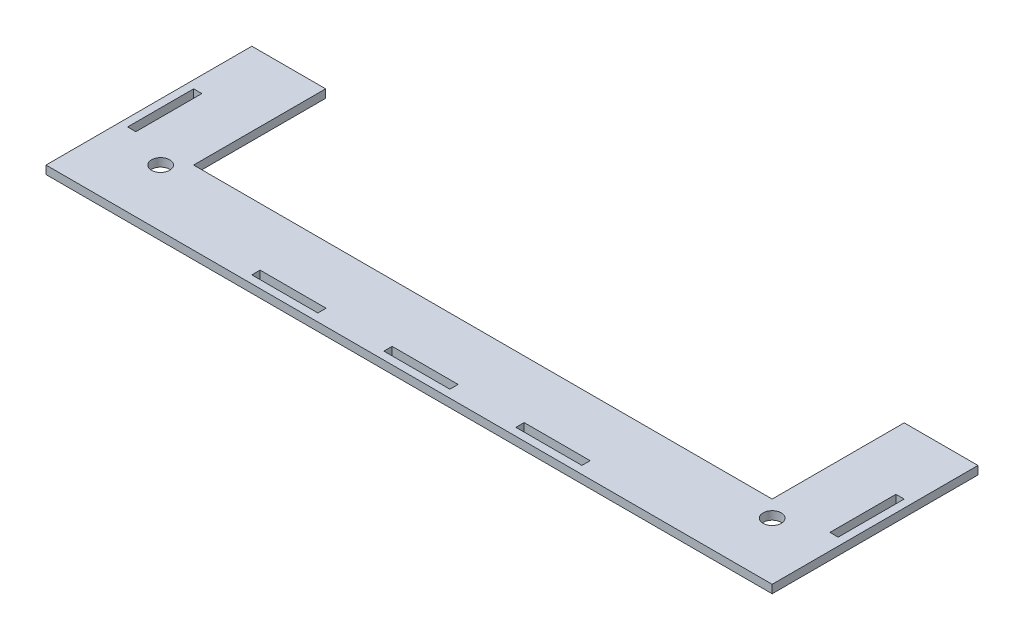
ISO-10303-21;
HEADER;
FILE_DESCRIPTION(('STEP AP214'),'2;1');
FILE_NAME('part.step','',(''),(''),'','','');
FILE_SCHEMA(('AUTOMOTIVE_DESIGN { 1 0 10303 214 1 1 1 1 }'));
ENDSEC;
DATA;
#1=APPLICATION_CONTEXT('core data for automotive mechanical design processes');
#2=APPLICATION_PROTOCOL_DEFINITION('international standard','automotive_design',2000,#1);
#3=PRODUCT_CONTEXT('',#1,'mechanical');
#4=PRODUCT('Part','Part','',(#3));
#5=PRODUCT_RELATED_PRODUCT_CATEGORY('part','',(#4));
#6=PRODUCT_DEFINITION_FORMATION('','',#4);
#7=PRODUCT_DEFINITION_CONTEXT('part definition',#1,'design');
#8=PRODUCT_DEFINITION('design','',#6,#7);
#9=PRODUCT_DEFINITION_SHAPE('','',#8);
#10=(LENGTH_UNIT() NAMED_UNIT(*) SI_UNIT(.MILLI.,.METRE.));
#11=(NAMED_UNIT(*) PLANE_ANGLE_UNIT() SI_UNIT($,.RADIAN.));
#12=(NAMED_UNIT(*) SI_UNIT($,.STERADIAN.) SOLID_ANGLE_UNIT());
#13=UNCERTAINTY_MEASURE_WITH_UNIT(LENGTH_MEASURE(1.E-05),#10,'distance_accuracy_value','');
#14=(GEOMETRIC_REPRESENTATION_CONTEXT(3) GLOBAL_UNCERTAINTY_ASSIGNED_CONTEXT((#13)) GLOBAL_UNIT_ASSIGNED_CONTEXT((#10,
#11,#12)) REPRESENTATION_CONTEXT('',''));
#15=CARTESIAN_POINT('',(0.,0.,0.));
#16=DIRECTION('',(0.,0.,1.));
#17=DIRECTION('',(1.,0.,0.));
#18=AXIS2_PLACEMENT_3D('',#15,#16,#17);
#19=CARTESIAN_POINT('',(63.5,3.175,0.));
#20=DIRECTION('',(-1.,0.,0.));
#21=DIRECTION('',(0.,0.,1.));
#22=AXIS2_PLACEMENT_3D('',#19,#20,#21);
#23=PLANE('',#22);
#24=DIRECTION('',(0.,0.,-1.));
#25=VECTOR('',#24,1.);
#26=CARTESIAN_POINT('',(63.5,0.,0.));
#27=LINE('',#26,#25);
#28=CARTESIAN_POINT('',(63.5,0.,12.7));
#29=VERTEX_POINT('',#28);
#30=CARTESIAN_POINT('',(63.5,0.,9.52500000000007));
#31=VERTEX_POINT('',#30);
#32=EDGE_CURVE('E400',#29,#31,#27,.T.);
#33=ORIENTED_EDGE('',*,*,#32,.F.);
#34=DIRECTION('',(0.,-1.,0.));
#35=VECTOR('',#34,1.);
#36=CARTESIAN_POINT('',(63.5,3.175,12.7));
#37=LINE('',#36,#35);
#38=CARTESIAN_POINT('',(63.5,3.175,12.7));
#39=VERTEX_POINT('',#38);
#40=EDGE_CURVE('E11',#39,#29,#37,.T.);
#41=ORIENTED_EDGE('',*,*,#40,.F.);
#42=DIRECTION('',(0.,0.,-1.));
#43=VECTOR('',#42,1.);
#44=CARTESIAN_POINT('',(63.5,3.175,0.));
#45=LINE('',#44,#43);
#46=CARTESIAN_POINT('',(63.5,3.175,9.52500000000007));
#47=VERTEX_POINT('',#46);
#48=EDGE_CURVE('E249',#39,#47,#45,.T.);
#49=ORIENTED_EDGE('',*,*,#48,.T.);
#50=DIRECTION('',(0.,-1.,0.));
#51=VECTOR('',#50,1.);
#52=CARTESIAN_POINT('',(63.5,3.175,9.52500000000007));
#53=LINE('',#52,#51);
#54=EDGE_CURVE('E154',#47,#31,#53,.T.);
#55=ORIENTED_EDGE('',*,*,#54,.T.);
#56=EDGE_LOOP('',(#33,#41,#49,#55));
#57=FACE_BOUND('',#56,.T.);
#58=ADVANCED_FACE('F41',(#57),#23,.T.);
#59=CARTESIAN_POINT('',(0.,3.175,12.7));
#60=DIRECTION('',(0.,0.,1.));
#61=DIRECTION('',(1.,0.,0.));
#62=AXIS2_PLACEMENT_3D('',#59,#60,#61);
#63=PLANE('',#62);
#64=DIRECTION('',(-1.,0.,0.));
#65=VECTOR('',#64,1.);
#66=CARTESIAN_POINT('',(0.,0.,12.7));
#67=LINE('',#66,#65);
#68=CARTESIAN_POINT('',(38.1,0.,12.7));
#69=VERTEX_POINT('',#68);
#70=EDGE_CURVE('E256',#29,#69,#67,.T.);
#71=ORIENTED_EDGE('',*,*,#70,.T.);
#72=DIRECTION('',(0.,-1.,0.));
#73=VECTOR('',#72,1.);
#74=CARTESIAN_POINT('',(38.1,3.175,12.7));
#75=LINE('',#74,#73);
#76=CARTESIAN_POINT('',(38.1,3.175,12.7));
#77=VERTEX_POINT('',#76);
#78=EDGE_CURVE('E51',#77,#69,#75,.T.);
#79=ORIENTED_EDGE('',*,*,#78,.F.);
#80=DIRECTION('',(-1.,0.,0.));
#81=VECTOR('',#80,1.);
#82=CARTESIAN_POINT('',(0.,3.175,12.7));
#83=LINE('',#82,#81);
#84=EDGE_CURVE('E244',#39,#77,#83,.T.);
#85=ORIENTED_EDGE('',*,*,#84,.F.);
#86=ORIENTED_EDGE('',*,*,#40,.T.);
#87=EDGE_LOOP('',(#71,#79,#85,#86));
#88=FACE_BOUND('',#87,.T.);
#89=ADVANCED_FACE('F254',(#88),#63,.F.);
#90=CARTESIAN_POINT('',(38.1,3.175,0.));
#91=DIRECTION('',(-1.,0.,0.));
#92=DIRECTION('',(0.,0.,1.));
#93=AXIS2_PLACEMENT_3D('',#90,#91,#92);
#94=PLANE('',#93);
#95=DIRECTION('',(0.,0.,-1.));
#96=VECTOR('',#95,1.);
#97=CARTESIAN_POINT('',(38.1,0.,0.));
#98=LINE('',#97,#96);
#99=CARTESIAN_POINT('',(38.1,0.,9.52500000000007));
#100=VERTEX_POINT('',#99);
#101=EDGE_CURVE('E402',#69,#100,#98,.T.);
#102=ORIENTED_EDGE('',*,*,#101,.T.);
#103=DIRECTION('',(0.,-1.,0.));
#104=VECTOR('',#103,1.);
#105=CARTESIAN_POINT('',(38.1,3.175,9.52500000000007));
#106=LINE('',#105,#104);
#107=CARTESIAN_POINT('',(38.1,3.175,9.52500000000007));
#108=VERTEX_POINT('',#107);
#109=EDGE_CURVE('E243',#108,#100,#106,.T.);
#110=ORIENTED_EDGE('',*,*,#109,.F.);
#111=DIRECTION('',(0.,0.,-1.));
#112=VECTOR('',#111,1.);
#113=CARTESIAN_POINT('',(38.1,3.175,0.));
#114=LINE('',#113,#112);
#115=EDGE_CURVE('E237',#77,#108,#114,.T.);
#116=ORIENTED_EDGE('',*,*,#115,.F.);
#117=ORIENTED_EDGE('',*,*,#78,.T.);
#118=EDGE_LOOP('',(#102,#110,#116,#117));
#119=FACE_BOUND('',#118,.T.);
#120=ADVANCED_FACE('F240',(#119),#94,.F.);
#121=CARTESIAN_POINT('',(12.7,3.175,0.));
#122=DIRECTION('',(-1.,0.,0.));
#123=DIRECTION('',(0.,0.,1.));
#124=AXIS2_PLACEMENT_3D('',#121,#122,#123);
#125=PLANE('',#124);
#126=DIRECTION('',(0.,0.,-1.));
#127=VECTOR('',#126,1.);
#128=CARTESIAN_POINT('',(12.7,0.,0.));
#129=LINE('',#128,#127);
#130=CARTESIAN_POINT('',(12.7,0.,12.7));
#131=VERTEX_POINT('',#130);
#132=CARTESIAN_POINT('',(12.7,0.,9.52500000000007));
#133=VERTEX_POINT('',#132);
#134=EDGE_CURVE('E391',#131,#133,#129,.T.);
#135=ORIENTED_EDGE('',*,*,#134,.F.);
#136=DIRECTION('',(0.,-1.,0.));
#137=VECTOR('',#136,1.);
#138=CARTESIAN_POINT('',(12.7,3.175,12.7));
#139=LINE('',#138,#137);
#140=CARTESIAN_POINT('',(12.7,3.175,12.7));
#141=VERTEX_POINT('',#140);
#142=EDGE_CURVE('E270',#141,#131,#139,.T.);
#143=ORIENTED_EDGE('',*,*,#142,.F.);
#144=DIRECTION('',(0.,0.,-1.));
#145=VECTOR('',#144,1.);
#146=CARTESIAN_POINT('',(12.7,3.175,0.));
#147=LINE('',#146,#145);
#148=CARTESIAN_POINT('',(12.7,3.175,9.52500000000007));
#149=VERTEX_POINT('',#148);
#150=EDGE_CURVE('E463',#141,#149,#147,.T.);
#151=ORIENTED_EDGE('',*,*,#150,.T.);
#152=DIRECTION('',(0.,-1.,0.));
#153=VECTOR('',#152,1.);
#154=CARTESIAN_POINT('',(12.7,3.175,9.52500000000007));
#155=LINE('',#154,#153);
#156=EDGE_CURVE('E261',#149,#133,#155,.T.);
#157=ORIENTED_EDGE('',*,*,#156,.T.);
#158=EDGE_LOOP('',(#135,#143,#151,#157));
#159=FACE_BOUND('',#158,.T.);
#160=ADVANCED_FACE('F514',(#159),#125,.T.);
#161=CARTESIAN_POINT('',(-12.7,0.,12.7));
#162=VERTEX_POINT('',#161);
#163=EDGE_CURVE('E385',#131,#162,#67,.T.);
#164=ORIENTED_EDGE('',*,*,#163,.T.);
#165=DIRECTION('',(0.,-1.,0.));
#166=VECTOR('',#165,1.);
#167=CARTESIAN_POINT('',(-12.7,3.175,12.7));
#168=LINE('',#167,#166);
#169=CARTESIAN_POINT('',(-12.7,3.175,12.7));
#170=VERTEX_POINT('',#169);
#171=EDGE_CURVE('E267',#170,#162,#168,.T.);
#172=ORIENTED_EDGE('',*,*,#171,.F.);
#173=EDGE_CURVE('E252',#141,#170,#83,.T.);
#174=ORIENTED_EDGE('',*,*,#173,.F.);
#175=ORIENTED_EDGE('',*,*,#142,.T.);
#176=EDGE_LOOP('',(#164,#172,#174,#175));
#177=FACE_BOUND('',#176,.T.);
#178=ADVANCED_FACE('F500',(#177),#63,.F.);
#179=CARTESIAN_POINT('',(-12.7,3.175,0.));
#180=DIRECTION('',(-1.,0.,0.));
#181=DIRECTION('',(0.,0.,1.));
#182=AXIS2_PLACEMENT_3D('',#179,#180,#181);
#183=PLANE('',#182);
#184=DIRECTION('',(0.,0.,-1.));
#185=VECTOR('',#184,1.);
#186=CARTESIAN_POINT('',(-12.7,0.,0.));
#187=LINE('',#186,#185);
#188=CARTESIAN_POINT('',(-12.7,0.,9.52500000000007));
#189=VERTEX_POINT('',#188);
#190=EDGE_CURVE('E394',#162,#189,#187,.T.);
#191=ORIENTED_EDGE('',*,*,#190,.T.);
#192=DIRECTION('',(0.,-1.,0.));
#193=VECTOR('',#192,1.);
#194=CARTESIAN_POINT('',(-12.7,3.175,9.52500000000007));
#195=LINE('',#194,#193);
#196=CARTESIAN_POINT('',(-12.7,3.175,9.52500000000007));
#197=VERTEX_POINT('',#196);
#198=EDGE_CURVE('E263',#197,#189,#195,.T.);
#199=ORIENTED_EDGE('',*,*,#198,.F.);
#200=DIRECTION('',(0.,0.,-1.));
#201=VECTOR('',#200,1.);
#202=CARTESIAN_POINT('',(-12.7,3.175,0.));
#203=LINE('',#202,#201);
#204=EDGE_CURVE('E466',#170,#197,#203,.T.);
#205=ORIENTED_EDGE('',*,*,#204,.F.);
#206=ORIENTED_EDGE('',*,*,#171,.T.);
#207=EDGE_LOOP('',(#191,#199,#205,#206));
#208=FACE_BOUND('',#207,.T.);
#209=ADVANCED_FACE('F509',(#208),#183,.F.);
#210=CARTESIAN_POINT('',(-38.1,3.175,0.));
#211=DIRECTION('',(-1.,0.,0.));
#212=DIRECTION('',(0.,0.,1.));
#213=AXIS2_PLACEMENT_3D('',#210,#211,#212);
#214=PLANE('',#213);
#215=DIRECTION('',(0.,0.,-1.));
#216=VECTOR('',#215,1.);
#217=CARTESIAN_POINT('',(-38.1,0.,0.));
#218=LINE('',#217,#216);
#219=CARTESIAN_POINT('',(-38.1,0.,12.7));
#220=VERTEX_POINT('',#219);
#221=CARTESIAN_POINT('',(-38.1,0.,9.52500000000007));
#222=VERTEX_POINT('',#221);
#223=EDGE_CURVE('E378',#220,#222,#218,.T.);
#224=ORIENTED_EDGE('',*,*,#223,.F.);
#225=DIRECTION('',(0.,-1.,0.));
#226=VECTOR('',#225,1.);
#227=CARTESIAN_POINT('',(-38.1,3.175,12.7));
#228=LINE('',#227,#226);
#229=CARTESIAN_POINT('',(-38.1,3.175,12.7));
#230=VERTEX_POINT('',#229);
#231=EDGE_CURVE('E264',#230,#220,#228,.T.);
#232=ORIENTED_EDGE('',*,*,#231,.F.);
#233=DIRECTION('',(0.,0.,-1.));
#234=VECTOR('',#233,1.);
#235=CARTESIAN_POINT('',(-38.1,3.175,0.));
#236=LINE('',#235,#234);
#237=CARTESIAN_POINT('',(-38.1,3.175,9.52500000000007));
#238=VERTEX_POINT('',#237);
#239=EDGE_CURVE('E454',#230,#238,#236,.T.);
#240=ORIENTED_EDGE('',*,*,#239,.T.);
#241=DIRECTION('',(0.,-1.,0.));
#242=VECTOR('',#241,1.);
#243=CARTESIAN_POINT('',(-38.1,3.175,9.52500000000007));
#244=LINE('',#243,#242);
#245=EDGE_CURVE('E272',#238,#222,#244,.T.);
#246=ORIENTED_EDGE('',*,*,#245,.T.);
#247=EDGE_LOOP('',(#224,#232,#240,#246));
#248=FACE_BOUND('',#247,.T.);
#249=ADVANCED_FACE('F512',(#248),#214,.T.);
#250=CARTESIAN_POINT('',(-63.5,0.,12.7));
#251=VERTEX_POINT('',#250);
#252=EDGE_CURVE('E381',#220,#251,#67,.T.);
#253=ORIENTED_EDGE('',*,*,#252,.T.);
#254=DIRECTION('',(0.,-1.,0.));
#255=VECTOR('',#254,1.);
#256=CARTESIAN_POINT('',(-63.5,3.175,12.7));
#257=LINE('',#256,#255);
#258=CARTESIAN_POINT('',(-63.5,3.175,12.7));
#259=VERTEX_POINT('',#258);
#260=EDGE_CURVE('E278',#259,#251,#257,.T.);
#261=ORIENTED_EDGE('',*,*,#260,.F.);
#262=EDGE_CURVE('E253',#230,#259,#83,.T.);
#263=ORIENTED_EDGE('',*,*,#262,.F.);
#264=ORIENTED_EDGE('',*,*,#231,.T.);
#265=EDGE_LOOP('',(#253,#261,#263,#264));
#266=FACE_BOUND('',#265,.T.);
#267=ADVANCED_FACE('F499',(#266),#63,.F.);
#268=CARTESIAN_POINT('',(-63.5,3.175,0.));
#269=DIRECTION('',(-1.,0.,0.));
#270=DIRECTION('',(0.,0.,1.));
#271=AXIS2_PLACEMENT_3D('',#268,#269,#270);
#272=PLANE('',#271);
#273=DIRECTION('',(0.,0.,-1.));
#274=VECTOR('',#273,1.);
#275=CARTESIAN_POINT('',(-63.5,0.,0.));
#276=LINE('',#275,#274);
#277=CARTESIAN_POINT('',(-63.5,0.,9.52500000000007));
#278=VERTEX_POINT('',#277);
#279=EDGE_CURVE('E384',#251,#278,#276,.T.);
#280=ORIENTED_EDGE('',*,*,#279,.T.);
#281=DIRECTION('',(0.,-1.,0.));
#282=VECTOR('',#281,1.);
#283=CARTESIAN_POINT('',(-63.5,3.175,9.52500000000007));
#284=LINE('',#283,#282);
#285=CARTESIAN_POINT('',(-63.5,3.175,9.52500000000007));
#286=VERTEX_POINT('',#285);
#287=EDGE_CURVE('E274',#286,#278,#284,.T.);
#288=ORIENTED_EDGE('',*,*,#287,.F.);
#289=DIRECTION('',(0.,0.,-1.));
#290=VECTOR('',#289,1.);
#291=CARTESIAN_POINT('',(-63.5,3.175,0.));
#292=LINE('',#291,#290);
#293=EDGE_CURVE('E458',#259,#286,#292,.T.);
#294=ORIENTED_EDGE('',*,*,#293,.F.);
#295=ORIENTED_EDGE('',*,*,#260,.T.);
#296=EDGE_LOOP('',(#280,#288,#294,#295));
#297=FACE_BOUND('',#296,.T.);
#298=ADVANCED_FACE('F522',(#297),#272,.F.);
#299=CARTESIAN_POINT('',(0.,3.175,-12.7000000000001));
#300=DIRECTION('',(0.,0.,-1.));
#301=DIRECTION('',(-1.,0.,0.));
#302=AXIS2_PLACEMENT_3D('',#299,#300,#301);
#303=PLANE('',#302);
#304=DIRECTION('',(1.,0.,0.));
#305=VECTOR('',#304,1.);
#306=CARTESIAN_POINT('',(0.,0.,-12.7000000000001));
#307=LINE('',#306,#305);
#308=CARTESIAN_POINT('',(-136.7,0.,-12.7000000000001));
#309=VERTEX_POINT('',#308);
#310=CARTESIAN_POINT('',(-133.525,0.,-12.7000000000001));
#311=VERTEX_POINT('',#310);
#312=EDGE_CURVE('E366',#309,#311,#307,.T.);
#313=ORIENTED_EDGE('',*,*,#312,.F.);
#314=DIRECTION('',(0.,-1.,0.));
#315=VECTOR('',#314,1.);
#316=CARTESIAN_POINT('',(-136.7,3.175,-12.7000000000001));
#317=LINE('',#316,#315);
#318=CARTESIAN_POINT('',(-136.7,3.175,-12.7000000000001));
#319=VERTEX_POINT('',#318);
#320=EDGE_CURVE('E275',#319,#309,#317,.T.);
#321=ORIENTED_EDGE('',*,*,#320,.F.);
#322=DIRECTION('',(1.,0.,0.));
#323=VECTOR('',#322,1.);
#324=CARTESIAN_POINT('',(0.,3.175,-12.7000000000001));
#325=LINE('',#324,#323);
#326=CARTESIAN_POINT('',(-133.525,3.175,-12.7000000000001));
#327=VERTEX_POINT('',#326);
#328=EDGE_CURVE('E443',#319,#327,#325,.T.);
#329=ORIENTED_EDGE('',*,*,#328,.T.);
#330=DIRECTION('',(0.,-1.,0.));
#331=VECTOR('',#330,1.);
#332=CARTESIAN_POINT('',(-133.525,3.175,-12.7000000000001));
#333=LINE('',#332,#331);
#334=EDGE_CURVE('E282',#327,#311,#333,.T.);
#335=ORIENTED_EDGE('',*,*,#334,.T.);
#336=EDGE_LOOP('',(#313,#321,#329,#335));
#337=FACE_BOUND('',#336,.T.);
#338=ADVANCED_FACE('F525',(#337),#303,.T.);
#339=CARTESIAN_POINT('',(-136.7,3.175,0.));
#340=DIRECTION('',(-1.,0.,0.));
#341=DIRECTION('',(0.,0.,1.));
#342=AXIS2_PLACEMENT_3D('',#339,#340,#341);
#343=PLANE('',#342);
#344=DIRECTION('',(0.,0.,-1.));
#345=VECTOR('',#344,1.);
#346=CARTESIAN_POINT('',(-136.7,0.,0.));
#347=LINE('',#346,#345);
#348=CARTESIAN_POINT('',(-136.7,0.,-38.1));
#349=VERTEX_POINT('',#348);
#350=EDGE_CURVE('E369',#309,#349,#347,.T.);
#351=ORIENTED_EDGE('',*,*,#350,.T.);
#352=DIRECTION('',(0.,-1.,0.));
#353=VECTOR('',#352,1.);
#354=CARTESIAN_POINT('',(-136.7,3.175,-38.1));
#355=LINE('',#354,#353);
#356=CARTESIAN_POINT('',(-136.7,3.175,-38.1));
#357=VERTEX_POINT('',#356);
#358=EDGE_CURVE('E287',#357,#349,#355,.T.);
#359=ORIENTED_EDGE('',*,*,#358,.F.);
#360=DIRECTION('',(0.,0.,-1.));
#361=VECTOR('',#360,1.);
#362=CARTESIAN_POINT('',(-136.7,3.175,0.));
#363=LINE('',#362,#361);
#364=EDGE_CURVE('E446',#319,#357,#363,.T.);
#365=ORIENTED_EDGE('',*,*,#364,.F.);
#366=ORIENTED_EDGE('',*,*,#320,.T.);
#367=EDGE_LOOP('',(#351,#359,#365,#366));
#368=FACE_BOUND('',#367,.T.);
#369=ADVANCED_FACE('F538',(#368),#343,.F.);
#370=CARTESIAN_POINT('',(0.,3.175,-38.0999999999997));
#371=DIRECTION('',(0.,0.,-1.));
#372=DIRECTION('',(-1.,0.,0.));
#373=AXIS2_PLACEMENT_3D('',#370,#371,#372);
#374=PLANE('',#373);
#375=DIRECTION('',(1.,0.,0.));
#376=VECTOR('',#375,1.);
#377=CARTESIAN_POINT('',(0.,0.,-38.0999999999997));
#378=LINE('',#377,#376);
#379=CARTESIAN_POINT('',(-133.525,0.,-38.1));
#380=VERTEX_POINT('',#379);
#381=EDGE_CURVE('E372',#349,#380,#378,.T.);
#382=ORIENTED_EDGE('',*,*,#381,.T.);
#383=DIRECTION('',(0.,-1.,0.));
#384=VECTOR('',#383,1.);
#385=CARTESIAN_POINT('',(-133.525,3.175,-38.1));
#386=LINE('',#385,#384);
#387=CARTESIAN_POINT('',(-133.525,3.175,-38.1));
#388=VERTEX_POINT('',#387);
#389=EDGE_CURVE('E284',#388,#380,#386,.T.);
#390=ORIENTED_EDGE('',*,*,#389,.F.);
#391=DIRECTION('',(1.,0.,0.));
#392=VECTOR('',#391,1.);
#393=CARTESIAN_POINT('',(0.,3.175,-38.0999999999997));
#394=LINE('',#393,#392);
#395=EDGE_CURVE('E449',#357,#388,#394,.T.);
#396=ORIENTED_EDGE('',*,*,#395,.F.);
#397=ORIENTED_EDGE('',*,*,#358,.T.);
#398=EDGE_LOOP('',(#382,#390,#396,#397));
#399=FACE_BOUND('',#398,.T.);
#400=ADVANCED_FACE('F534',(#399),#374,.F.);
#401=CARTESIAN_POINT('',(0.,3.175,-63.5));
#402=DIRECTION('',(0.,0.,-1.));
#403=DIRECTION('',(-1.,0.,0.));
#404=AXIS2_PLACEMENT_3D('',#401,#402,#403);
#405=PLANE('',#404);
#406=DIRECTION('',(1.,0.,0.));
#407=VECTOR('',#406,1.);
#408=CARTESIAN_POINT('',(0.,0.,-63.5));
#409=LINE('',#408,#407);
#410=CARTESIAN_POINT('',(-139.7,0.,-63.5));
#411=VERTEX_POINT('',#410);
#412=CARTESIAN_POINT('',(-111.3,0.,-63.5));
#413=VERTEX_POINT('',#412);
#414=EDGE_CURVE('E342',#411,#413,#409,.T.);
#415=ORIENTED_EDGE('',*,*,#414,.F.);
#416=DIRECTION('',(0.,-1.,0.));
#417=VECTOR('',#416,1.);
#418=CARTESIAN_POINT('',(-139.7,3.175,-63.5));
#419=LINE('',#418,#417);
#420=CARTESIAN_POINT('',(-139.7,3.175,-63.5));
#421=VERTEX_POINT('',#420);
#422=EDGE_CURVE('E285',#421,#411,#419,.T.);
#423=ORIENTED_EDGE('',*,*,#422,.F.);
#424=DIRECTION('',(1.,0.,0.));
#425=VECTOR('',#424,1.);
#426=CARTESIAN_POINT('',(0.,3.175,-63.5));
#427=LINE('',#426,#425);
#428=CARTESIAN_POINT('',(-111.3,3.175,-63.5));
#429=VERTEX_POINT('',#428);
#430=EDGE_CURVE('E420',#421,#429,#427,.T.);
#431=ORIENTED_EDGE('',*,*,#430,.T.);
#432=DIRECTION('',(0.,-1.,0.));
#433=VECTOR('',#432,1.);
#434=CARTESIAN_POINT('',(-111.3,3.175,-63.5));
#435=LINE('',#434,#433);
#436=EDGE_CURVE('E291',#429,#413,#435,.T.);
#437=ORIENTED_EDGE('',*,*,#436,.T.);
#438=EDGE_LOOP('',(#415,#423,#431,#437));
#439=FACE_BOUND('',#438,.T.);
#440=ADVANCED_FACE('F537',(#439),#405,.T.);
#441=CARTESIAN_POINT('',(-139.7,3.175,0.));
#442=DIRECTION('',(1.,0.,0.));
#443=DIRECTION('',(0.,0.,-1.));
#444=AXIS2_PLACEMENT_3D('',#441,#442,#443);
#445=PLANE('',#444);
#446=DIRECTION('',(0.,0.,1.));
#447=VECTOR('',#446,1.);
#448=CARTESIAN_POINT('',(-139.7,0.,0.));
#449=LINE('',#448,#447);
#450=CARTESIAN_POINT('',(-139.7,0.,15.7));
#451=VERTEX_POINT('',#450);
#452=EDGE_CURVE('E345',#411,#451,#449,.T.);
#453=ORIENTED_EDGE('',*,*,#452,.T.);
#454=DIRECTION('',(0.,-1.,0.));
#455=VECTOR('',#454,1.);
#456=CARTESIAN_POINT('',(-139.7,3.175,15.7));
#457=LINE('',#456,#455);
#458=CARTESIAN_POINT('',(-139.7,3.175,15.7));
#459=VERTEX_POINT('',#458);
#460=EDGE_CURVE('E304',#459,#451,#457,.T.);
#461=ORIENTED_EDGE('',*,*,#460,.F.);
#462=DIRECTION('',(0.,0.,1.));
#463=VECTOR('',#462,1.);
#464=CARTESIAN_POINT('',(-139.7,3.175,0.));
#465=LINE('',#464,#463);
#466=EDGE_CURVE('E423',#421,#459,#465,.T.);
#467=ORIENTED_EDGE('',*,*,#466,.F.);
#468=ORIENTED_EDGE('',*,*,#422,.T.);
#469=EDGE_LOOP('',(#453,#461,#467,#468));
#470=FACE_BOUND('',#469,.T.);
#471=ADVANCED_FACE('F568',(#470),#445,.F.);
#472=CARTESIAN_POINT('',(0.,3.175,15.7));
#473=DIRECTION('',(0.,0.,-1.));
#474=DIRECTION('',(-1.,0.,0.));
#475=AXIS2_PLACEMENT_3D('',#472,#473,#474);
#476=PLANE('',#475);
#477=DIRECTION('',(1.,0.,0.));
#478=VECTOR('',#477,1.);
#479=CARTESIAN_POINT('',(0.,0.,15.7));
#480=LINE('',#479,#478);
#481=CARTESIAN_POINT('',(139.7,0.,15.7));
#482=VERTEX_POINT('',#481);
#483=EDGE_CURVE('E348',#451,#482,#480,.T.);
#484=ORIENTED_EDGE('',*,*,#483,.T.);
#485=DIRECTION('',(0.,-1.,0.));
#486=VECTOR('',#485,1.);
#487=CARTESIAN_POINT('',(139.7,3.175,15.7));
#488=LINE('',#487,#486);
#489=CARTESIAN_POINT('',(139.7,3.175,15.7));
#490=VERTEX_POINT('',#489);
#491=EDGE_CURVE('E301',#490,#482,#488,.T.);
#492=ORIENTED_EDGE('',*,*,#491,.F.);
#493=DIRECTION('',(1.,0.,0.));
#494=VECTOR('',#493,1.);
#495=CARTESIAN_POINT('',(0.,3.175,15.7));
#496=LINE('',#495,#494);
#497=EDGE_CURVE('E426',#459,#490,#496,.T.);
#498=ORIENTED_EDGE('',*,*,#497,.F.);
#499=ORIENTED_EDGE('',*,*,#460,.T.);
#500=EDGE_LOOP('',(#484,#492,#498,#499));
#501=FACE_BOUND('',#500,.T.);
#502=ADVANCED_FACE('F564',(#501),#476,.F.);
#503=CARTESIAN_POINT('',(139.7,3.175,0.));
#504=DIRECTION('',(-1.,0.,0.));
#505=DIRECTION('',(0.,0.,1.));
#506=AXIS2_PLACEMENT_3D('',#503,#504,#505);
#507=PLANE('',#506);
#508=DIRECTION('',(0.,0.,-1.));
#509=VECTOR('',#508,1.);
#510=CARTESIAN_POINT('',(139.7,0.,0.));
#511=LINE('',#510,#509);
#512=CARTESIAN_POINT('',(139.7,0.,-63.5));
#513=VERTEX_POINT('',#512);
#514=EDGE_CURVE('E351',#482,#513,#511,.T.);
#515=ORIENTED_EDGE('',*,*,#514,.T.);
#516=DIRECTION('',(0.,-1.,0.));
#517=VECTOR('',#516,1.);
#518=CARTESIAN_POINT('',(139.7,3.175,-63.5));
#519=LINE('',#518,#517);
#520=CARTESIAN_POINT('',(139.7,3.175,-63.5));
#521=VERTEX_POINT('',#520);
#522=EDGE_CURVE('E299',#521,#513,#519,.T.);
#523=ORIENTED_EDGE('',*,*,#522,.F.);
#524=DIRECTION('',(0.,0.,-1.));
#525=VECTOR('',#524,1.);
#526=CARTESIAN_POINT('',(139.7,3.175,0.));
#527=LINE('',#526,#525);
#528=EDGE_CURVE('E429',#490,#521,#527,.T.);
#529=ORIENTED_EDGE('',*,*,#528,.F.);
#530=ORIENTED_EDGE('',*,*,#491,.T.);
#531=EDGE_LOOP('',(#515,#523,#529,#530));
#532=FACE_BOUND('',#531,.T.);
#533=ADVANCED_FACE('F560',(#532),#507,.F.);
#534=CARTESIAN_POINT('',(0.,3.175,-63.5));
#535=DIRECTION('',(0.,0.,-1.));
#536=DIRECTION('',(-1.,0.,0.));
#537=AXIS2_PLACEMENT_3D('',#534,#535,#536);
#538=PLANE('',#537);
#539=DIRECTION('',(1.,0.,0.));
#540=VECTOR('',#539,1.);
#541=CARTESIAN_POINT('',(0.,0.,-63.5));
#542=LINE('',#541,#540);
#543=CARTESIAN_POINT('',(111.3,0.,-63.5));
#544=VERTEX_POINT('',#543);
#545=EDGE_CURVE('E354',#544,#513,#542,.T.);
#546=ORIENTED_EDGE('',*,*,#545,.F.);
#547=DIRECTION('',(0.,-1.,0.));
#548=VECTOR('',#547,1.);
#549=CARTESIAN_POINT('',(111.3,3.175,-63.5));
#550=LINE('',#549,#548);
#551=CARTESIAN_POINT('',(111.3,3.175,-63.5));
#552=VERTEX_POINT('',#551);
#553=EDGE_CURVE('E297',#552,#544,#550,.T.);
#554=ORIENTED_EDGE('',*,*,#553,.F.);
#555=DIRECTION('',(1.,0.,0.));
#556=VECTOR('',#555,1.);
#557=CARTESIAN_POINT('',(0.,3.175,-63.5));
#558=LINE('',#557,#556);
#559=EDGE_CURVE('E431',#552,#521,#558,.T.);
#560=ORIENTED_EDGE('',*,*,#559,.T.);
#561=ORIENTED_EDGE('',*,*,#522,.T.);
#562=EDGE_LOOP('',(#546,#554,#560,#561));
#563=FACE_BOUND('',#562,.T.);
#564=ADVANCED_FACE('F556',(#563),#538,.T.);
#565=CARTESIAN_POINT('',(111.3,3.175,0.));
#566=DIRECTION('',(-1.,0.,0.));
#567=DIRECTION('',(0.,0.,1.));
#568=AXIS2_PLACEMENT_3D('',#565,#566,#567);
#569=PLANE('',#568);
#570=DIRECTION('',(0.,0.,-1.));
#571=VECTOR('',#570,1.);
#572=CARTESIAN_POINT('',(111.3,0.,0.));
#573=LINE('',#572,#571);
#574=CARTESIAN_POINT('',(111.3,0.,-12.7));
#575=VERTEX_POINT('',#574);
#576=EDGE_CURVE('E357',#575,#544,#573,.T.);
#577=ORIENTED_EDGE('',*,*,#576,.F.);
#578=DIRECTION('',(0.,-1.,0.));
#579=VECTOR('',#578,1.);
#580=CARTESIAN_POINT('',(111.3,3.175,-12.7));
#581=LINE('',#580,#579);
#582=CARTESIAN_POINT('',(111.3,3.175,-12.7));
#583=VERTEX_POINT('',#582);
#584=EDGE_CURVE('E295',#583,#575,#581,.T.);
#585=ORIENTED_EDGE('',*,*,#584,.F.);
#586=DIRECTION('',(0.,0.,-1.));
#587=VECTOR('',#586,1.);
#588=CARTESIAN_POINT('',(111.3,3.175,0.));
#589=LINE('',#588,#587);
#590=EDGE_CURVE('E434',#583,#552,#589,.T.);
#591=ORIENTED_EDGE('',*,*,#590,.T.);
#592=ORIENTED_EDGE('',*,*,#553,.T.);
#593=EDGE_LOOP('',(#577,#585,#591,#592));
#594=FACE_BOUND('',#593,.T.);
#595=ADVANCED_FACE('F552',(#594),#569,.T.);
#596=CARTESIAN_POINT('',(0.,3.175,-12.7));
#597=DIRECTION('',(0.,0.,-1.));
#598=DIRECTION('',(-1.,0.,0.));
#599=AXIS2_PLACEMENT_3D('',#596,#597,#598);
#600=PLANE('',#599);
#601=DIRECTION('',(1.,0.,0.));
#602=VECTOR('',#601,1.);
#603=CARTESIAN_POINT('',(0.,0.,-12.7));
#604=LINE('',#603,#602);
#605=CARTESIAN_POINT('',(-111.3,0.,-12.7));
#606=VERTEX_POINT('',#605);
#607=EDGE_CURVE('E360',#606,#575,#604,.T.);
#608=ORIENTED_EDGE('',*,*,#607,.F.);
#609=DIRECTION('',(0.,-1.,0.));
#610=VECTOR('',#609,1.);
#611=CARTESIAN_POINT('',(-111.3,3.175,-12.7));
#612=LINE('',#611,#610);
#613=CARTESIAN_POINT('',(-111.3,3.175,-12.7));
#614=VERTEX_POINT('',#613);
#615=EDGE_CURVE('E293',#614,#606,#612,.T.);
#616=ORIENTED_EDGE('',*,*,#615,.F.);
#617=DIRECTION('',(1.,0.,0.));
#618=VECTOR('',#617,1.);
#619=CARTESIAN_POINT('',(0.,3.175,-12.7));
#620=LINE('',#619,#618);
#621=EDGE_CURVE('E437',#614,#583,#620,.T.);
#622=ORIENTED_EDGE('',*,*,#621,.T.);
#623=ORIENTED_EDGE('',*,*,#584,.T.);
#624=EDGE_LOOP('',(#608,#616,#622,#623));
#625=FACE_BOUND('',#624,.T.);
#626=ADVANCED_FACE('F549',(#625),#600,.T.);
#627=CARTESIAN_POINT('',(-1.16573417585628E-12,3.175,-38.0999999999959));
#628=DIRECTION('',(0.,0.,1.));
#629=DIRECTION('',(1.,0.,0.));
#630=AXIS2_PLACEMENT_3D('',#627,#628,#629);
#631=PLANE('',#630);
#632=DIRECTION('',(-1.,0.,0.));
#633=VECTOR('',#632,1.);
#634=CARTESIAN_POINT('',(-1.16573417585628E-12,0.,-38.0999999999959));
#635=LINE('',#634,#633);
#636=CARTESIAN_POINT('',(136.7,0.,-38.1));
#637=VERTEX_POINT('',#636);
#638=CARTESIAN_POINT('',(133.525,0.,-38.0999999999999));
#639=VERTEX_POINT('',#638);
#640=EDGE_CURVE('E330',#637,#639,#635,.T.);
#641=ORIENTED_EDGE('',*,*,#640,.F.);
#642=DIRECTION('',(0.,-1.,0.));
#643=VECTOR('',#642,1.);
#644=CARTESIAN_POINT('',(136.7,3.175,-38.1));
#645=LINE('',#644,#643);
#646=CARTESIAN_POINT('',(136.7,3.175,-38.1));
#647=VERTEX_POINT('',#646);
#648=EDGE_CURVE('E45',#647,#637,#645,.T.);
#649=ORIENTED_EDGE('',*,*,#648,.F.);
#650=DIRECTION('',(-1.,0.,0.));
#651=VECTOR('',#650,1.);
#652=CARTESIAN_POINT('',(-1.16573417585628E-12,3.175,-38.0999999999959));
#653=LINE('',#652,#651);
#654=CARTESIAN_POINT('',(133.525,3.175,-38.0999999999999));
#655=VERTEX_POINT('',#654);
#656=EDGE_CURVE('E410',#647,#655,#653,.T.);
#657=ORIENTED_EDGE('',*,*,#656,.T.);
#658=DIRECTION('',(0.,-1.,0.));
#659=VECTOR('',#658,1.);
#660=CARTESIAN_POINT('',(133.525,3.175,-38.0999999999999));
#661=LINE('',#660,#659);
#662=EDGE_CURVE('E308',#655,#639,#661,.T.);
#663=ORIENTED_EDGE('',*,*,#662,.T.);
#664=EDGE_LOOP('',(#641,#649,#657,#663));
#665=FACE_BOUND('',#664,.T.);
#666=ADVANCED_FACE('F43',(#665),#631,.T.);
#667=CARTESIAN_POINT('',(136.7,3.175,0.));
#668=DIRECTION('',(1.,0.,0.));
#669=DIRECTION('',(0.,0.,-1.));
#670=AXIS2_PLACEMENT_3D('',#667,#668,#669);
#671=PLANE('',#670);
#672=DIRECTION('',(0.,0.,1.));
#673=VECTOR('',#672,1.);
#674=CARTESIAN_POINT('',(136.7,0.,0.));
#675=LINE('',#674,#673);
#676=CARTESIAN_POINT('',(136.7,0.,-12.7));
#677=VERTEX_POINT('',#676);
#678=EDGE_CURVE('E322',#637,#677,#675,.T.);
#679=ORIENTED_EDGE('',*,*,#678,.T.);
#680=DIRECTION('',(0.,-1.,0.));
#681=VECTOR('',#680,1.);
#682=CARTESIAN_POINT('',(136.7,3.175,-12.7));
#683=LINE('',#682,#681);
#684=CARTESIAN_POINT('',(136.7,3.175,-12.7));
#685=VERTEX_POINT('',#684);
#686=EDGE_CURVE('E313',#685,#677,#683,.T.);
#687=ORIENTED_EDGE('',*,*,#686,.F.);
#688=DIRECTION('',(0.,0.,1.));
#689=VECTOR('',#688,1.);
#690=CARTESIAN_POINT('',(136.7,3.175,0.));
#691=LINE('',#690,#689);
#692=EDGE_CURVE('E323',#647,#685,#691,.T.);
#693=ORIENTED_EDGE('',*,*,#692,.F.);
#694=ORIENTED_EDGE('',*,*,#648,.T.);
#695=EDGE_LOOP('',(#679,#687,#693,#694));
#696=FACE_BOUND('',#695,.T.);
#697=ADVANCED_FACE('F321',(#696),#671,.F.);
#698=CARTESIAN_POINT('',(-5.96744875735722E-13,3.175,-12.6999999999937));
#699=DIRECTION('',(0.,0.,1.));
#700=DIRECTION('',(1.,0.,0.));
#701=AXIS2_PLACEMENT_3D('',#698,#699,#700);
#702=PLANE('',#701);
#703=DIRECTION('',(-1.,0.,0.));
#704=VECTOR('',#703,1.);
#705=CARTESIAN_POINT('',(-5.96744875735722E-13,0.,-12.6999999999937));
#706=LINE('',#705,#704);
#707=CARTESIAN_POINT('',(133.525,0.,-12.7));
#708=VERTEX_POINT('',#707);
#709=EDGE_CURVE('E331',#677,#708,#706,.T.);
#710=ORIENTED_EDGE('',*,*,#709,.T.);
#711=DIRECTION('',(0.,-1.,0.));
#712=VECTOR('',#711,1.);
#713=CARTESIAN_POINT('',(133.525,3.175,-12.7));
#714=LINE('',#713,#712);
#715=CARTESIAN_POINT('',(133.525,3.175,-12.7));
#716=VERTEX_POINT('',#715);
#717=EDGE_CURVE('E310',#716,#708,#714,.T.);
#718=ORIENTED_EDGE('',*,*,#717,.F.);
#719=DIRECTION('',(-1.,0.,0.));
#720=VECTOR('',#719,1.);
#721=CARTESIAN_POINT('',(-5.96744875735722E-13,3.175,-12.6999999999937));
#722=LINE('',#721,#720);
#723=EDGE_CURVE('E414',#685,#716,#722,.T.);
#724=ORIENTED_EDGE('',*,*,#723,.F.);
#725=ORIENTED_EDGE('',*,*,#686,.T.);
#726=EDGE_LOOP('',(#710,#718,#724,#725));
#727=FACE_BOUND('',#726,.T.);
#728=ADVANCED_FACE('F579',(#727),#702,.F.);
#729=CARTESIAN_POINT('',(117.65,3.175,-6.35000000000001));
#730=DIRECTION('',(0.,-1.,0.));
#731=DIRECTION('',(0.,0.,-1.));
#732=AXIS2_PLACEMENT_3D('',#729,#730,#731);
#733=CYLINDRICAL_SURFACE('',#732,3.49999999999999);
#734=CARTESIAN_POINT('',(117.65,3.175,-6.35000000000001));
#735=DIRECTION('',(0.,1.,0.));
#736=DIRECTION('',(0.,0.,1.));
#737=AXIS2_PLACEMENT_3D('',#734,#735,#736);
#738=CIRCLE('',#737,3.49999999999999);
#739=CARTESIAN_POINT('',(117.65,3.175,-2.85000000000002));
#740=VERTEX_POINT('',#739);
#741=EDGE_CURVE('E472',#740,#740,#738,.T.);
#742=ORIENTED_EDGE('',*,*,#741,.T.);
#743=EDGE_LOOP('',(#742));
#744=FACE_BOUND('',#743,.T.);
#745=CARTESIAN_POINT('',(117.65,0.,-6.35000000000001));
#746=DIRECTION('',(0.,1.,0.));
#747=DIRECTION('',(0.,0.,1.));
#748=AXIS2_PLACEMENT_3D('',#745,#746,#747);
#749=CIRCLE('',#748,3.49999999999999);
#750=CARTESIAN_POINT('',(117.65,0.,-2.85000000000002));
#751=VERTEX_POINT('',#750);
#752=EDGE_CURVE('E405',#751,#751,#749,.T.);
#753=ORIENTED_EDGE('',*,*,#752,.F.);
#754=EDGE_LOOP('',(#753));
#755=FACE_BOUND('',#754,.T.);
#756=ADVANCED_FACE('F581',(#744,#755),#733,.F.);
#757=CARTESIAN_POINT('',(0.,3.175,9.52500000000007));
#758=DIRECTION('',(0.,0.,-1.));
#759=DIRECTION('',(-1.,0.,0.));
#760=AXIS2_PLACEMENT_3D('',#757,#758,#759);
#761=PLANE('',#760);
#762=DIRECTION('',(1.,0.,0.));
#763=VECTOR('',#762,1.);
#764=CARTESIAN_POINT('',(0.,0.,9.52500000000007));
#765=LINE('',#764,#763);
#766=EDGE_CURVE('E147',#100,#31,#765,.T.);
#767=ORIENTED_EDGE('',*,*,#766,.T.);
#768=ORIENTED_EDGE('',*,*,#54,.F.);
#769=DIRECTION('',(1.,0.,0.));
#770=VECTOR('',#769,1.);
#771=CARTESIAN_POINT('',(0.,3.175,9.52500000000007));
#772=LINE('',#771,#770);
#773=EDGE_CURVE('E60',#108,#47,#772,.T.);
#774=ORIENTED_EDGE('',*,*,#773,.F.);
#775=ORIENTED_EDGE('',*,*,#109,.T.);
#776=EDGE_LOOP('',(#767,#768,#774,#775));
#777=FACE_BOUND('',#776,.T.);
#778=ADVANCED_FACE('F507',(#777),#761,.F.);
#779=CARTESIAN_POINT('',(0.,3.175,9.52500000000007));
#780=DIRECTION('',(0.,0.,-1.));
#781=DIRECTION('',(-1.,0.,0.));
#782=AXIS2_PLACEMENT_3D('',#779,#780,#781);
#783=PLANE('',#782);
#784=DIRECTION('',(1.,0.,0.));
#785=VECTOR('',#784,1.);
#786=CARTESIAN_POINT('',(0.,0.,9.52500000000007));
#787=LINE('',#786,#785);
#788=EDGE_CURVE('E397',#189,#133,#787,.T.);
#789=ORIENTED_EDGE('',*,*,#788,.T.);
#790=ORIENTED_EDGE('',*,*,#156,.F.);
#791=DIRECTION('',(1.,0.,0.));
#792=VECTOR('',#791,1.);
#793=CARTESIAN_POINT('',(0.,3.175,9.52500000000007));
#794=LINE('',#793,#792);
#795=EDGE_CURVE('E469',#197,#149,#794,.T.);
#796=ORIENTED_EDGE('',*,*,#795,.F.);
#797=ORIENTED_EDGE('',*,*,#198,.T.);
#798=EDGE_LOOP('',(#789,#790,#796,#797));
#799=FACE_BOUND('',#798,.T.);
#800=ADVANCED_FACE('F503',(#799),#783,.F.);
#801=CARTESIAN_POINT('',(0.,3.175,9.52500000000007));
#802=DIRECTION('',(0.,0.,-1.));
#803=DIRECTION('',(-1.,0.,0.));
#804=AXIS2_PLACEMENT_3D('',#801,#802,#803);
#805=PLANE('',#804);
#806=DIRECTION('',(1.,0.,0.));
#807=VECTOR('',#806,1.);
#808=CARTESIAN_POINT('',(0.,0.,9.52500000000007));
#809=LINE('',#808,#807);
#810=EDGE_CURVE('E388',#278,#222,#809,.T.);
#811=ORIENTED_EDGE('',*,*,#810,.T.);
#812=ORIENTED_EDGE('',*,*,#245,.F.);
#813=DIRECTION('',(1.,0.,0.));
#814=VECTOR('',#813,1.);
#815=CARTESIAN_POINT('',(0.,3.175,9.52500000000007));
#816=LINE('',#815,#814);
#817=EDGE_CURVE('E461',#286,#238,#816,.T.);
#818=ORIENTED_EDGE('',*,*,#817,.F.);
#819=ORIENTED_EDGE('',*,*,#287,.T.);
#820=EDGE_LOOP('',(#811,#812,#818,#819));
#821=FACE_BOUND('',#820,.T.);
#822=ADVANCED_FACE('F506',(#821),#805,.F.);
#823=CARTESIAN_POINT('',(-133.525,3.175,0.));
#824=DIRECTION('',(-1.,0.,0.));
#825=DIRECTION('',(0.,0.,1.));
#826=AXIS2_PLACEMENT_3D('',#823,#824,#825);
#827=PLANE('',#826);
#828=DIRECTION('',(0.,0.,-1.));
#829=VECTOR('',#828,1.);
#830=CARTESIAN_POINT('',(-133.525,0.,0.));
#831=LINE('',#830,#829);
#832=EDGE_CURVE('E375',#311,#380,#831,.T.);
#833=ORIENTED_EDGE('',*,*,#832,.F.);
#834=ORIENTED_EDGE('',*,*,#334,.F.);
#835=DIRECTION('',(0.,0.,-1.));
#836=VECTOR('',#835,1.);
#837=CARTESIAN_POINT('',(-133.525,3.175,0.));
#838=LINE('',#837,#836);
#839=EDGE_CURVE('E451',#327,#388,#838,.T.);
#840=ORIENTED_EDGE('',*,*,#839,.T.);
#841=ORIENTED_EDGE('',*,*,#389,.T.);
#842=EDGE_LOOP('',(#833,#834,#840,#841));
#843=FACE_BOUND('',#842,.T.);
#844=ADVANCED_FACE('F520',(#843),#827,.T.);
#845=CARTESIAN_POINT('',(-111.3,3.175,0.));
#846=DIRECTION('',(1.,0.,0.));
#847=DIRECTION('',(0.,0.,-1.));
#848=AXIS2_PLACEMENT_3D('',#845,#846,#847);
#849=PLANE('',#848);
#850=DIRECTION('',(0.,0.,1.));
#851=VECTOR('',#850,1.);
#852=CARTESIAN_POINT('',(-111.3,0.,0.));
#853=LINE('',#852,#851);
#854=EDGE_CURVE('E363',#413,#606,#853,.T.);
#855=ORIENTED_EDGE('',*,*,#854,.F.);
#856=ORIENTED_EDGE('',*,*,#436,.F.);
#857=DIRECTION('',(0.,0.,1.));
#858=VECTOR('',#857,1.);
#859=CARTESIAN_POINT('',(-111.3,3.175,0.));
#860=LINE('',#859,#858);
#861=EDGE_CURVE('E440',#429,#614,#860,.T.);
#862=ORIENTED_EDGE('',*,*,#861,.T.);
#863=ORIENTED_EDGE('',*,*,#615,.T.);
#864=EDGE_LOOP('',(#855,#856,#862,#863));
#865=FACE_BOUND('',#864,.T.);
#866=ADVANCED_FACE('F532',(#865),#849,.T.);
#867=CARTESIAN_POINT('',(133.525,3.175,0.));
#868=DIRECTION('',(-1.,0.,0.));
#869=DIRECTION('',(0.,0.,1.));
#870=AXIS2_PLACEMENT_3D('',#867,#868,#869);
#871=PLANE('',#870);
#872=DIRECTION('',(0.,0.,-1.));
#873=VECTOR('',#872,1.);
#874=CARTESIAN_POINT('',(133.525,0.,0.));
#875=LINE('',#874,#873);
#876=EDGE_CURVE('E340',#708,#639,#875,.T.);
#877=ORIENTED_EDGE('',*,*,#876,.T.);
#878=ORIENTED_EDGE('',*,*,#662,.F.);
#879=DIRECTION('',(0.,0.,-1.));
#880=VECTOR('',#879,1.);
#881=CARTESIAN_POINT('',(133.525,3.175,0.));
#882=LINE('',#881,#880);
#883=EDGE_CURVE('E418',#716,#655,#882,.T.);
#884=ORIENTED_EDGE('',*,*,#883,.F.);
#885=ORIENTED_EDGE('',*,*,#717,.T.);
#886=EDGE_LOOP('',(#877,#878,#884,#885));
#887=FACE_BOUND('',#886,.T.);
#888=ADVANCED_FACE('F490',(#887),#871,.F.);
#889=CARTESIAN_POINT('',(-117.65,3.175,-6.34999999999998));
#890=DIRECTION('',(0.,-1.,0.));
#891=DIRECTION('',(0.,0.,-1.));
#892=AXIS2_PLACEMENT_3D('',#889,#890,#891);
#893=CYLINDRICAL_SURFACE('',#892,3.50000000000001);
#894=CARTESIAN_POINT('',(-117.65,3.175,-6.34999999999998));
#895=DIRECTION('',(0.,1.,0.));
#896=DIRECTION('',(0.,0.,1.));
#897=AXIS2_PLACEMENT_3D('',#894,#895,#896);
#898=CIRCLE('',#897,3.50000000000001);
#899=CARTESIAN_POINT('',(-117.65,3.175,-2.84999999999998));
#900=VERTEX_POINT('',#899);
#901=EDGE_CURVE('E311',#900,#900,#898,.T.);
#902=ORIENTED_EDGE('',*,*,#901,.T.);
#903=EDGE_LOOP('',(#902));
#904=FACE_BOUND('',#903,.T.);
#905=CARTESIAN_POINT('',(-117.65,0.,-6.34999999999998));
#906=DIRECTION('',(0.,1.,0.));
#907=DIRECTION('',(0.,0.,1.));
#908=AXIS2_PLACEMENT_3D('',#905,#906,#907);
#909=CIRCLE('',#908,3.50000000000001);
#910=CARTESIAN_POINT('',(-117.65,0.,-2.84999999999998));
#911=VERTEX_POINT('',#910);
#912=EDGE_CURVE('E408',#911,#911,#909,.T.);
#913=ORIENTED_EDGE('',*,*,#912,.F.);
#914=EDGE_LOOP('',(#913));
#915=FACE_BOUND('',#914,.T.);
#916=ADVANCED_FACE('F479',(#904,#915),#893,.F.);
#917=CARTESIAN_POINT('',(0.,3.175,0.));
#918=DIRECTION('',(0.,1.,0.));
#919=DIRECTION('',(0.,0.,1.));
#920=AXIS2_PLACEMENT_3D('',#917,#918,#919);
#921=PLANE('',#920);
#922=ORIENTED_EDGE('',*,*,#656,.F.);
#923=ORIENTED_EDGE('',*,*,#692,.T.);
#924=ORIENTED_EDGE('',*,*,#723,.T.);
#925=ORIENTED_EDGE('',*,*,#883,.T.);
#926=EDGE_LOOP('',(#922,#923,#924,#925));
#927=FACE_BOUND('',#926,.T.);
#928=ORIENTED_EDGE('',*,*,#430,.F.);
#929=ORIENTED_EDGE('',*,*,#466,.T.);
#930=ORIENTED_EDGE('',*,*,#497,.T.);
#931=ORIENTED_EDGE('',*,*,#528,.T.);
#932=ORIENTED_EDGE('',*,*,#559,.F.);
#933=ORIENTED_EDGE('',*,*,#590,.F.);
#934=ORIENTED_EDGE('',*,*,#621,.F.);
#935=ORIENTED_EDGE('',*,*,#861,.F.);
#936=EDGE_LOOP('',(#928,#929,#930,#931,#932,#933,#934,#935));
#937=FACE_BOUND('',#936,.T.);
#938=ORIENTED_EDGE('',*,*,#328,.F.);
#939=ORIENTED_EDGE('',*,*,#364,.T.);
#940=ORIENTED_EDGE('',*,*,#395,.T.);
#941=ORIENTED_EDGE('',*,*,#839,.F.);
#942=EDGE_LOOP('',(#938,#939,#940,#941));
#943=FACE_BOUND('',#942,.T.);
#944=ORIENTED_EDGE('',*,*,#239,.F.);
#945=ORIENTED_EDGE('',*,*,#262,.T.);
#946=ORIENTED_EDGE('',*,*,#293,.T.);
#947=ORIENTED_EDGE('',*,*,#817,.T.);
#948=EDGE_LOOP('',(#944,#945,#946,#947));
#949=FACE_BOUND('',#948,.T.);
#950=ORIENTED_EDGE('',*,*,#150,.F.);
#951=ORIENTED_EDGE('',*,*,#173,.T.);
#952=ORIENTED_EDGE('',*,*,#204,.T.);
#953=ORIENTED_EDGE('',*,*,#795,.T.);
#954=EDGE_LOOP('',(#950,#951,#952,#953));
#955=FACE_BOUND('',#954,.T.);
#956=ORIENTED_EDGE('',*,*,#48,.F.);
#957=ORIENTED_EDGE('',*,*,#84,.T.);
#958=ORIENTED_EDGE('',*,*,#115,.T.);
#959=ORIENTED_EDGE('',*,*,#773,.T.);
#960=EDGE_LOOP('',(#956,#957,#958,#959));
#961=FACE_BOUND('',#960,.T.);
#962=ORIENTED_EDGE('',*,*,#741,.F.);
#963=EDGE_LOOP('',(#962));
#964=FACE_BOUND('',#963,.T.);
#965=ORIENTED_EDGE('',*,*,#901,.F.);
#966=EDGE_LOOP('',(#965));
#967=FACE_BOUND('',#966,.T.);
#968=ADVANCED_FACE('F247',(#927,#937,#943,#949,#955,#961,#964,#967),#921,.T.);
#969=CARTESIAN_POINT('',(0.,0.,0.));
#970=DIRECTION('',(0.,1.,0.));
#971=DIRECTION('',(0.,0.,1.));
#972=AXIS2_PLACEMENT_3D('',#969,#970,#971);
#973=PLANE('',#972);
#974=ORIENTED_EDGE('',*,*,#640,.T.);
#975=ORIENTED_EDGE('',*,*,#876,.F.);
#976=ORIENTED_EDGE('',*,*,#709,.F.);
#977=ORIENTED_EDGE('',*,*,#678,.F.);
#978=EDGE_LOOP('',(#974,#975,#976,#977));
#979=FACE_BOUND('',#978,.T.);
#980=ORIENTED_EDGE('',*,*,#414,.T.);
#981=ORIENTED_EDGE('',*,*,#854,.T.);
#982=ORIENTED_EDGE('',*,*,#607,.T.);
#983=ORIENTED_EDGE('',*,*,#576,.T.);
#984=ORIENTED_EDGE('',*,*,#545,.T.);
#985=ORIENTED_EDGE('',*,*,#514,.F.);
#986=ORIENTED_EDGE('',*,*,#483,.F.);
#987=ORIENTED_EDGE('',*,*,#452,.F.);
#988=EDGE_LOOP('',(#980,#981,#982,#983,#984,#985,#986,#987));
#989=FACE_BOUND('',#988,.T.);
#990=ORIENTED_EDGE('',*,*,#312,.T.);
#991=ORIENTED_EDGE('',*,*,#832,.T.);
#992=ORIENTED_EDGE('',*,*,#381,.F.);
#993=ORIENTED_EDGE('',*,*,#350,.F.);
#994=EDGE_LOOP('',(#990,#991,#992,#993));
#995=FACE_BOUND('',#994,.T.);
#996=ORIENTED_EDGE('',*,*,#223,.T.);
#997=ORIENTED_EDGE('',*,*,#810,.F.);
#998=ORIENTED_EDGE('',*,*,#279,.F.);
#999=ORIENTED_EDGE('',*,*,#252,.F.);
#1000=EDGE_LOOP('',(#996,#997,#998,#999));
#1001=FACE_BOUND('',#1000,.T.);
#1002=ORIENTED_EDGE('',*,*,#134,.T.);
#1003=ORIENTED_EDGE('',*,*,#788,.F.);
#1004=ORIENTED_EDGE('',*,*,#190,.F.);
#1005=ORIENTED_EDGE('',*,*,#163,.F.);
#1006=EDGE_LOOP('',(#1002,#1003,#1004,#1005));
#1007=FACE_BOUND('',#1006,.T.);
#1008=ORIENTED_EDGE('',*,*,#32,.T.);
#1009=ORIENTED_EDGE('',*,*,#766,.F.);
#1010=ORIENTED_EDGE('',*,*,#101,.F.);
#1011=ORIENTED_EDGE('',*,*,#70,.F.);
#1012=EDGE_LOOP('',(#1008,#1009,#1010,#1011));
#1013=FACE_BOUND('',#1012,.T.);
#1014=ORIENTED_EDGE('',*,*,#752,.T.);
#1015=EDGE_LOOP('',(#1014));
#1016=FACE_BOUND('',#1015,.T.);
#1017=ORIENTED_EDGE('',*,*,#912,.T.);
#1018=EDGE_LOOP('',(#1017));
#1019=FACE_BOUND('',#1018,.T.);
#1020=ADVANCED_FACE('F327',(#979,#989,#995,#1001,#1007,#1013,#1016,#1019),#973,.F.);
#1021=CLOSED_SHELL('',(#58,#89,#120,#160,#178,#209,#249,#267,#298,#338,#369,#400,#440,#471,#502,
#533,#564,#595,#626,#666,#697,#728,#756,#778,#800,#822,#844,#866,#888,#916,#968,#1020));
#1022=MANIFOLD_SOLID_BREP('B2',#1021);
#1023=ADVANCED_BREP_SHAPE_REPRESENTATION('',(#18,#1022),#14);
#1024=SHAPE_DEFINITION_REPRESENTATION(#9,#1023);
ENDSEC;
END-ISO-10303-21;
